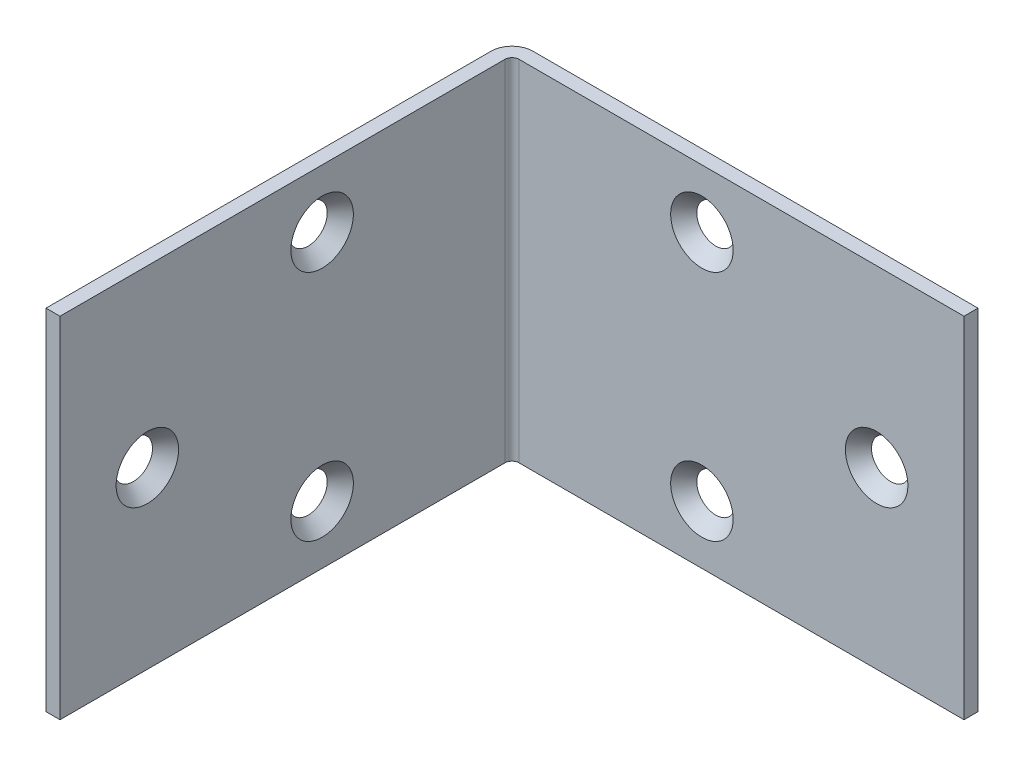
ISO-10303-21;
HEADER;
FILE_DESCRIPTION(('STEP AP214'),'2;1');
FILE_NAME('part.step','',(''),(''),'','','');
FILE_SCHEMA(('AUTOMOTIVE_DESIGN { 1 0 10303 214 1 1 1 1 }'));
ENDSEC;
DATA;
#1=APPLICATION_CONTEXT('core data for automotive mechanical design processes');
#2=APPLICATION_PROTOCOL_DEFINITION('international standard','automotive_design',2000,#1);
#3=PRODUCT_CONTEXT('',#1,'mechanical');
#4=PRODUCT('Part','Part','',(#3));
#5=PRODUCT_RELATED_PRODUCT_CATEGORY('part','',(#4));
#6=PRODUCT_DEFINITION_FORMATION('','',#4);
#7=PRODUCT_DEFINITION_CONTEXT('part definition',#1,'design');
#8=PRODUCT_DEFINITION('design','',#6,#7);
#9=PRODUCT_DEFINITION_SHAPE('','',#8);
#10=(LENGTH_UNIT() NAMED_UNIT(*) SI_UNIT(.MILLI.,.METRE.));
#11=(NAMED_UNIT(*) PLANE_ANGLE_UNIT() SI_UNIT($,.RADIAN.));
#12=(NAMED_UNIT(*) SI_UNIT($,.STERADIAN.) SOLID_ANGLE_UNIT());
#13=UNCERTAINTY_MEASURE_WITH_UNIT(LENGTH_MEASURE(1.E-05),#10,'distance_accuracy_value','');
#14=(GEOMETRIC_REPRESENTATION_CONTEXT(3) GLOBAL_UNCERTAINTY_ASSIGNED_CONTEXT((#13)) GLOBAL_UNIT_ASSIGNED_CONTEXT((#10,
#11,#12)) REPRESENTATION_CONTEXT('',''));
#15=CARTESIAN_POINT('',(0.,0.,0.));
#16=DIRECTION('',(0.,0.,1.));
#17=DIRECTION('',(1.,0.,0.));
#18=AXIS2_PLACEMENT_3D('',#15,#16,#17);
#19=CARTESIAN_POINT('',(2.286,19.05,1.524));
#20=DIRECTION('',(0.,0.,-1.));
#21=DIRECTION('',(-1.,0.,0.));
#22=AXIS2_PLACEMENT_3D('',#19,#20,#21);
#23=PLANE('',#22);
#24=CARTESIAN_POINT('',(22.225,12.7,1.524));
#25=DIRECTION('',(0.,0.,-1.));
#26=DIRECTION('',(-1.,0.,0.));
#27=AXIS2_PLACEMENT_3D('',#24,#25,#26);
#28=CIRCLE('',#27,3.40759298843187);
#29=CARTESIAN_POINT('',(18.8174070115681,12.7,1.524));
#30=VERTEX_POINT('',#29);
#31=EDGE_CURVE('E203',#30,#30,#28,.F.);
#32=ORIENTED_EDGE('',*,*,#31,.F.);
#33=EDGE_LOOP('',(#32));
#34=FACE_BOUND('',#33,.T.);
#35=DIRECTION('',(1.,0.,0.));
#36=VECTOR('',#35,1.);
#37=CARTESIAN_POINT('',(2.286,-19.05,1.524));
#38=LINE('',#37,#36);
#39=CARTESIAN_POINT('',(2.286,-19.05,1.524));
#40=VERTEX_POINT('',#39);
#41=CARTESIAN_POINT('',(50.8,-19.05,1.524));
#42=VERTEX_POINT('',#41);
#43=EDGE_CURVE('E131',#40,#42,#38,.T.);
#44=ORIENTED_EDGE('',*,*,#43,.T.);
#45=DIRECTION('',(0.,-1.,0.));
#46=VECTOR('',#45,1.);
#47=CARTESIAN_POINT('',(50.8,19.05,1.524));
#48=LINE('',#47,#46);
#49=CARTESIAN_POINT('',(50.8,19.05,1.524));
#50=VERTEX_POINT('',#49);
#51=EDGE_CURVE('E11',#50,#42,#48,.T.);
#52=ORIENTED_EDGE('',*,*,#51,.F.);
#53=DIRECTION('',(1.,0.,0.));
#54=VECTOR('',#53,1.);
#55=CARTESIAN_POINT('',(2.286,19.05,1.524));
#56=LINE('',#55,#54);
#57=CARTESIAN_POINT('',(2.286,19.05,1.524));
#58=VERTEX_POINT('',#57);
#59=EDGE_CURVE('E89',#58,#50,#56,.T.);
#60=ORIENTED_EDGE('',*,*,#59,.F.);
#61=DIRECTION('',(0.,-1.,0.));
#62=VECTOR('',#61,1.);
#63=CARTESIAN_POINT('',(2.286,19.05,1.524));
#64=LINE('',#63,#62);
#65=EDGE_CURVE('E130',#58,#40,#64,.T.);
#66=ORIENTED_EDGE('',*,*,#65,.T.);
#67=EDGE_LOOP('',(#44,#52,#60,#66));
#68=FACE_BOUND('',#67,.T.);
#69=CARTESIAN_POINT('',(22.225,-12.7,1.524));
#70=DIRECTION('',(0.,0.,-1.));
#71=DIRECTION('',(-1.,0.,0.));
#72=AXIS2_PLACEMENT_3D('',#69,#70,#71);
#73=CIRCLE('',#72,3.40759298843187);
#74=CARTESIAN_POINT('',(18.8174070115681,-12.7,1.524));
#75=VERTEX_POINT('',#74);
#76=EDGE_CURVE('E197',#75,#75,#73,.F.);
#77=ORIENTED_EDGE('',*,*,#76,.F.);
#78=EDGE_LOOP('',(#77));
#79=FACE_BOUND('',#78,.T.);
#80=CARTESIAN_POINT('',(41.275,0.,1.524));
#81=DIRECTION('',(0.,0.,-1.));
#82=DIRECTION('',(-1.,0.,0.));
#83=AXIS2_PLACEMENT_3D('',#80,#81,#82);
#84=CIRCLE('',#83,3.40759298843181);
#85=CARTESIAN_POINT('',(37.8674070115682,0.,1.524));
#86=VERTEX_POINT('',#85);
#87=EDGE_CURVE('E209',#86,#86,#84,.F.);
#88=ORIENTED_EDGE('',*,*,#87,.F.);
#89=EDGE_LOOP('',(#88));
#90=FACE_BOUND('',#89,.T.);
#91=ADVANCED_FACE('F34',(#34,#68,#79,#90),#23,.F.);
#92=CARTESIAN_POINT('',(2.286,19.05,0.));
#93=DIRECTION('',(0.,0.,-1.));
#94=DIRECTION('',(-1.,0.,0.));
#95=AXIS2_PLACEMENT_3D('',#92,#93,#94);
#96=PLANE('',#95);
#97=CARTESIAN_POINT('',(22.225,12.7,0.));
#98=DIRECTION('',(0.,0.,1.));
#99=DIRECTION('',(1.,0.,0.));
#100=AXIS2_PLACEMENT_3D('',#97,#98,#99);
#101=CIRCLE('',#100,2.0828);
#102=CARTESIAN_POINT('',(24.3078,12.7,0.));
#103=VERTEX_POINT('',#102);
#104=EDGE_CURVE('E206',#103,#103,#101,.T.);
#105=ORIENTED_EDGE('',*,*,#104,.T.);
#106=EDGE_LOOP('',(#105));
#107=FACE_BOUND('',#106,.T.);
#108=DIRECTION('',(1.,0.,0.));
#109=VECTOR('',#108,1.);
#110=CARTESIAN_POINT('',(2.286,-19.05,0.));
#111=LINE('',#110,#109);
#112=CARTESIAN_POINT('',(2.286,-19.05,0.));
#113=VERTEX_POINT('',#112);
#114=CARTESIAN_POINT('',(50.8,-19.05,0.));
#115=VERTEX_POINT('',#114);
#116=EDGE_CURVE('E138',#113,#115,#111,.T.);
#117=ORIENTED_EDGE('',*,*,#116,.F.);
#118=DIRECTION('',(0.,-1.,0.));
#119=VECTOR('',#118,1.);
#120=CARTESIAN_POINT('',(2.286,19.05,0.));
#121=LINE('',#120,#119);
#122=CARTESIAN_POINT('',(2.286,19.05,0.));
#123=VERTEX_POINT('',#122);
#124=EDGE_CURVE('E155',#123,#113,#121,.T.);
#125=ORIENTED_EDGE('',*,*,#124,.F.);
#126=DIRECTION('',(1.,0.,0.));
#127=VECTOR('',#126,1.);
#128=CARTESIAN_POINT('',(2.286,19.05,0.));
#129=LINE('',#128,#127);
#130=CARTESIAN_POINT('',(50.8,19.05,0.));
#131=VERTEX_POINT('',#130);
#132=EDGE_CURVE('E163',#123,#131,#129,.T.);
#133=ORIENTED_EDGE('',*,*,#132,.T.);
#134=DIRECTION('',(0.,-1.,0.));
#135=VECTOR('',#134,1.);
#136=CARTESIAN_POINT('',(50.8,19.05,0.));
#137=LINE('',#136,#135);
#138=EDGE_CURVE('E42',#131,#115,#137,.T.);
#139=ORIENTED_EDGE('',*,*,#138,.T.);
#140=EDGE_LOOP('',(#117,#125,#133,#139));
#141=FACE_BOUND('',#140,.T.);
#142=CARTESIAN_POINT('',(41.275,0.,1.3747336602421E-13));
#143=DIRECTION('',(0.,0.,1.));
#144=DIRECTION('',(1.,0.,0.));
#145=AXIS2_PLACEMENT_3D('',#142,#143,#144);
#146=CIRCLE('',#145,2.0828);
#147=CARTESIAN_POINT('',(43.3578,0.,1.44410483571278E-13));
#148=VERTEX_POINT('',#147);
#149=EDGE_CURVE('E212',#148,#148,#146,.T.);
#150=ORIENTED_EDGE('',*,*,#149,.T.);
#151=EDGE_LOOP('',(#150));
#152=FACE_BOUND('',#151,.T.);
#153=CARTESIAN_POINT('',(22.225,-12.7,0.));
#154=DIRECTION('',(0.,0.,1.));
#155=DIRECTION('',(1.,0.,0.));
#156=AXIS2_PLACEMENT_3D('',#153,#154,#155);
#157=CIRCLE('',#156,2.0828);
#158=CARTESIAN_POINT('',(24.3078,-12.7,0.));
#159=VERTEX_POINT('',#158);
#160=EDGE_CURVE('E200',#159,#159,#157,.T.);
#161=ORIENTED_EDGE('',*,*,#160,.T.);
#162=EDGE_LOOP('',(#161));
#163=FACE_BOUND('',#162,.T.);
#164=ADVANCED_FACE('F160',(#107,#141,#152,#163),#96,.T.);
#165=CARTESIAN_POINT('',(50.8,19.05,0.));
#166=DIRECTION('',(1.,0.,0.));
#167=DIRECTION('',(0.,0.,-1.));
#168=AXIS2_PLACEMENT_3D('',#165,#166,#167);
#169=PLANE('',#168);
#170=DIRECTION('',(0.,0.,1.));
#171=VECTOR('',#170,1.);
#172=CARTESIAN_POINT('',(50.8,-19.05,0.));
#173=LINE('',#172,#171);
#174=EDGE_CURVE('E134',#115,#42,#173,.T.);
#175=ORIENTED_EDGE('',*,*,#174,.F.);
#176=ORIENTED_EDGE('',*,*,#138,.F.);
#177=DIRECTION('',(0.,0.,1.));
#178=VECTOR('',#177,1.);
#179=CARTESIAN_POINT('',(50.8,19.05,0.));
#180=LINE('',#179,#178);
#181=EDGE_CURVE('E175',#131,#50,#180,.T.);
#182=ORIENTED_EDGE('',*,*,#181,.T.);
#183=ORIENTED_EDGE('',*,*,#51,.T.);
#184=EDGE_LOOP('',(#175,#176,#182,#183));
#185=FACE_BOUND('',#184,.T.);
#186=ADVANCED_FACE('F166',(#185),#169,.T.);
#187=CARTESIAN_POINT('',(2.286,19.05,2.286));
#188=DIRECTION('',(0.,-1.,0.));
#189=DIRECTION('',(0.,0.,-1.));
#190=AXIS2_PLACEMENT_3D('',#187,#188,#189);
#191=CYLINDRICAL_SURFACE('',#190,2.286);
#192=CARTESIAN_POINT('',(2.286,-19.05,2.286));
#193=DIRECTION('',(0.,-1.,0.));
#194=DIRECTION('',(0.,0.,1.));
#195=AXIS2_PLACEMENT_3D('',#192,#193,#194);
#196=CIRCLE('',#195,2.286);
#197=CARTESIAN_POINT('',(0.,-19.05,2.286));
#198=VERTEX_POINT('',#197);
#199=EDGE_CURVE('E141',#198,#113,#196,.T.);
#200=ORIENTED_EDGE('',*,*,#199,.F.);
#201=DIRECTION('',(0.,-1.,0.));
#202=VECTOR('',#201,1.);
#203=CARTESIAN_POINT('',(0.,19.05,2.286));
#204=LINE('',#203,#202);
#205=CARTESIAN_POINT('',(0.,19.05,2.286));
#206=VERTEX_POINT('',#205);
#207=EDGE_CURVE('E153',#206,#198,#204,.T.);
#208=ORIENTED_EDGE('',*,*,#207,.F.);
#209=CARTESIAN_POINT('',(2.286,19.05,2.286));
#210=DIRECTION('',(0.,-1.,0.));
#211=DIRECTION('',(0.,0.,1.));
#212=AXIS2_PLACEMENT_3D('',#209,#210,#211);
#213=CIRCLE('',#212,2.286);
#214=EDGE_CURVE('E125',#206,#123,#213,.T.);
#215=ORIENTED_EDGE('',*,*,#214,.T.);
#216=ORIENTED_EDGE('',*,*,#124,.T.);
#217=EDGE_LOOP('',(#200,#208,#215,#216));
#218=FACE_BOUND('',#217,.T.);
#219=ADVANCED_FACE('F173',(#218),#191,.T.);
#220=CARTESIAN_POINT('',(0.,19.05,50.8));
#221=DIRECTION('',(-1.,0.,0.));
#222=DIRECTION('',(0.,0.,1.));
#223=AXIS2_PLACEMENT_3D('',#220,#221,#222);
#224=PLANE('',#223);
#225=CARTESIAN_POINT('',(0.,-12.7,22.225));
#226=DIRECTION('',(-1.,0.,0.));
#227=DIRECTION('',(0.,0.,1.));
#228=AXIS2_PLACEMENT_3D('',#225,#226,#227);
#229=CIRCLE('',#228,2.0828);
#230=CARTESIAN_POINT('',(0.,-12.7,24.3078));
#231=VERTEX_POINT('',#230);
#232=EDGE_CURVE('E182',#231,#231,#229,.T.);
#233=ORIENTED_EDGE('',*,*,#232,.F.);
#234=EDGE_LOOP('',(#233));
#235=FACE_BOUND('',#234,.T.);
#236=CARTESIAN_POINT('',(0.,12.7,22.225));
#237=DIRECTION('',(-1.,0.,0.));
#238=DIRECTION('',(0.,0.,1.));
#239=AXIS2_PLACEMENT_3D('',#236,#237,#238);
#240=CIRCLE('',#239,2.0828);
#241=CARTESIAN_POINT('',(0.,12.7,24.3078));
#242=VERTEX_POINT('',#241);
#243=EDGE_CURVE('E188',#242,#242,#240,.T.);
#244=ORIENTED_EDGE('',*,*,#243,.F.);
#245=EDGE_LOOP('',(#244));
#246=FACE_BOUND('',#245,.T.);
#247=CARTESIAN_POINT('',(0.,0.,41.275));
#248=DIRECTION('',(-1.,0.,0.));
#249=DIRECTION('',(0.,0.,1.));
#250=AXIS2_PLACEMENT_3D('',#247,#248,#249);
#251=CIRCLE('',#250,2.0828);
#252=CARTESIAN_POINT('',(0.,0.,43.3578));
#253=VERTEX_POINT('',#252);
#254=EDGE_CURVE('E194',#253,#253,#251,.T.);
#255=ORIENTED_EDGE('',*,*,#254,.F.);
#256=EDGE_LOOP('',(#255));
#257=FACE_BOUND('',#256,.T.);
#258=DIRECTION('',(0.,0.,-1.));
#259=VECTOR('',#258,1.);
#260=CARTESIAN_POINT('',(0.,-19.05,50.8));
#261=LINE('',#260,#259);
#262=CARTESIAN_POINT('',(0.,-19.05,50.8));
#263=VERTEX_POINT('',#262);
#264=EDGE_CURVE('E144',#263,#198,#261,.T.);
#265=ORIENTED_EDGE('',*,*,#264,.F.);
#266=DIRECTION('',(0.,-1.,0.));
#267=VECTOR('',#266,1.);
#268=CARTESIAN_POINT('',(0.,19.05,50.8));
#269=LINE('',#268,#267);
#270=CARTESIAN_POINT('',(0.,19.05,50.8));
#271=VERTEX_POINT('',#270);
#272=EDGE_CURVE('E113',#271,#263,#269,.T.);
#273=ORIENTED_EDGE('',*,*,#272,.F.);
#274=DIRECTION('',(0.,0.,-1.));
#275=VECTOR('',#274,1.);
#276=CARTESIAN_POINT('',(0.,19.05,50.8));
#277=LINE('',#276,#275);
#278=EDGE_CURVE('E123',#271,#206,#277,.T.);
#279=ORIENTED_EDGE('',*,*,#278,.T.);
#280=ORIENTED_EDGE('',*,*,#207,.T.);
#281=EDGE_LOOP('',(#265,#273,#279,#280));
#282=FACE_BOUND('',#281,.T.);
#283=ADVANCED_FACE('F271',(#235,#246,#257,#282),#224,.T.);
#284=CARTESIAN_POINT('',(1.524,19.05,50.8));
#285=DIRECTION('',(0.,0.,1.));
#286=DIRECTION('',(1.,0.,0.));
#287=AXIS2_PLACEMENT_3D('',#284,#285,#286);
#288=PLANE('',#287);
#289=DIRECTION('',(-1.,0.,0.));
#290=VECTOR('',#289,1.);
#291=CARTESIAN_POINT('',(1.524,-19.05,50.8));
#292=LINE('',#291,#290);
#293=CARTESIAN_POINT('',(1.524,-19.05,50.8));
#294=VERTEX_POINT('',#293);
#295=EDGE_CURVE('E112',#294,#263,#292,.T.);
#296=ORIENTED_EDGE('',*,*,#295,.F.);
#297=DIRECTION('',(0.,-1.,0.));
#298=VECTOR('',#297,1.);
#299=CARTESIAN_POINT('',(1.524,19.05,50.8));
#300=LINE('',#299,#298);
#301=CARTESIAN_POINT('',(1.524,19.05,50.8));
#302=VERTEX_POINT('',#301);
#303=EDGE_CURVE('E106',#302,#294,#300,.T.);
#304=ORIENTED_EDGE('',*,*,#303,.F.);
#305=DIRECTION('',(-1.,0.,0.));
#306=VECTOR('',#305,1.);
#307=CARTESIAN_POINT('',(1.524,19.05,50.8));
#308=LINE('',#307,#306);
#309=EDGE_CURVE('E110',#302,#271,#308,.T.);
#310=ORIENTED_EDGE('',*,*,#309,.T.);
#311=ORIENTED_EDGE('',*,*,#272,.T.);
#312=EDGE_LOOP('',(#296,#304,#310,#311));
#313=FACE_BOUND('',#312,.T.);
#314=ADVANCED_FACE('F108',(#313),#288,.T.);
#315=CARTESIAN_POINT('',(1.524,19.05,50.8));
#316=DIRECTION('',(-1.,0.,0.));
#317=DIRECTION('',(0.,0.,1.));
#318=AXIS2_PLACEMENT_3D('',#315,#316,#317);
#319=PLANE('',#318);
#320=CARTESIAN_POINT('',(1.524,0.,41.275));
#321=DIRECTION('',(-1.,0.,0.));
#322=DIRECTION('',(0.,0.,1.));
#323=AXIS2_PLACEMENT_3D('',#320,#321,#322);
#324=CIRCLE('',#323,3.40759298843193);
#325=CARTESIAN_POINT('',(1.524,0.,44.6825929884319));
#326=VERTEX_POINT('',#325);
#327=EDGE_CURVE('E191',#326,#326,#324,.T.);
#328=ORIENTED_EDGE('',*,*,#327,.T.);
#329=EDGE_LOOP('',(#328));
#330=FACE_BOUND('',#329,.T.);
#331=CARTESIAN_POINT('',(1.524,12.7,22.225));
#332=DIRECTION('',(-1.,0.,0.));
#333=DIRECTION('',(0.,0.,1.));
#334=AXIS2_PLACEMENT_3D('',#331,#332,#333);
#335=CIRCLE('',#334,3.40759298843193);
#336=CARTESIAN_POINT('',(1.524,12.7,25.6325929884319));
#337=VERTEX_POINT('',#336);
#338=EDGE_CURVE('E185',#337,#337,#335,.T.);
#339=ORIENTED_EDGE('',*,*,#338,.T.);
#340=EDGE_LOOP('',(#339));
#341=FACE_BOUND('',#340,.T.);
#342=CARTESIAN_POINT('',(1.524,-12.7,22.225));
#343=DIRECTION('',(-1.,0.,0.));
#344=DIRECTION('',(0.,0.,1.));
#345=AXIS2_PLACEMENT_3D('',#342,#343,#344);
#346=CIRCLE('',#345,3.40759298843193);
#347=CARTESIAN_POINT('',(1.524,-12.7,25.6325929884319));
#348=VERTEX_POINT('',#347);
#349=EDGE_CURVE('E135',#348,#348,#346,.T.);
#350=ORIENTED_EDGE('',*,*,#349,.T.);
#351=EDGE_LOOP('',(#350));
#352=FACE_BOUND('',#351,.T.);
#353=DIRECTION('',(0.,0.,-1.));
#354=VECTOR('',#353,1.);
#355=CARTESIAN_POINT('',(1.524,-19.05,50.8));
#356=LINE('',#355,#354);
#357=CARTESIAN_POINT('',(1.524,-19.05,2.286));
#358=VERTEX_POINT('',#357);
#359=EDGE_CURVE('E77',#294,#358,#356,.T.);
#360=ORIENTED_EDGE('',*,*,#359,.T.);
#361=DIRECTION('',(0.,-1.,0.));
#362=VECTOR('',#361,1.);
#363=CARTESIAN_POINT('',(1.524,19.05,2.286));
#364=LINE('',#363,#362);
#365=CARTESIAN_POINT('',(1.524,19.05,2.286));
#366=VERTEX_POINT('',#365);
#367=EDGE_CURVE('E114',#366,#358,#364,.T.);
#368=ORIENTED_EDGE('',*,*,#367,.F.);
#369=DIRECTION('',(0.,0.,-1.));
#370=VECTOR('',#369,1.);
#371=CARTESIAN_POINT('',(1.524,19.05,50.8));
#372=LINE('',#371,#370);
#373=EDGE_CURVE('E116',#302,#366,#372,.T.);
#374=ORIENTED_EDGE('',*,*,#373,.F.);
#375=ORIENTED_EDGE('',*,*,#303,.T.);
#376=EDGE_LOOP('',(#360,#368,#374,#375));
#377=FACE_BOUND('',#376,.T.);
#378=ADVANCED_FACE('F117',(#330,#341,#352,#377),#319,.F.);
#379=CARTESIAN_POINT('',(2.286,19.05,2.286));
#380=DIRECTION('',(0.,-1.,0.));
#381=DIRECTION('',(0.,0.,-1.));
#382=AXIS2_PLACEMENT_3D('',#379,#380,#381);
#383=CYLINDRICAL_SURFACE('',#382,0.762);
#384=CARTESIAN_POINT('',(2.286,-19.05,2.286));
#385=DIRECTION('',(0.,1.,0.));
#386=DIRECTION('',(1.,0.,0.));
#387=AXIS2_PLACEMENT_3D('',#384,#385,#386);
#388=CIRCLE('',#387,0.762);
#389=EDGE_CURVE('E83',#358,#40,#388,.F.);
#390=ORIENTED_EDGE('',*,*,#389,.T.);
#391=ORIENTED_EDGE('',*,*,#65,.F.);
#392=CARTESIAN_POINT('',(2.286,19.05,2.286));
#393=DIRECTION('',(0.,1.,0.));
#394=DIRECTION('',(1.,0.,0.));
#395=AXIS2_PLACEMENT_3D('',#392,#393,#394);
#396=CIRCLE('',#395,0.762);
#397=EDGE_CURVE('E50',#366,#58,#396,.F.);
#398=ORIENTED_EDGE('',*,*,#397,.F.);
#399=ORIENTED_EDGE('',*,*,#367,.T.);
#400=EDGE_LOOP('',(#390,#391,#398,#399));
#401=FACE_BOUND('',#400,.T.);
#402=ADVANCED_FACE('F261',(#401),#383,.F.);
#403=CARTESIAN_POINT('',(2.286,19.05,2.286));
#404=DIRECTION('',(0.,-1.,0.));
#405=DIRECTION('',(-1.,0.,0.));
#406=AXIS2_PLACEMENT_3D('',#403,#404,#405);
#407=PLANE('',#406);
#408=ORIENTED_EDGE('',*,*,#59,.T.);
#409=ORIENTED_EDGE('',*,*,#181,.F.);
#410=ORIENTED_EDGE('',*,*,#132,.F.);
#411=ORIENTED_EDGE('',*,*,#214,.F.);
#412=ORIENTED_EDGE('',*,*,#278,.F.);
#413=ORIENTED_EDGE('',*,*,#309,.F.);
#414=ORIENTED_EDGE('',*,*,#373,.T.);
#415=ORIENTED_EDGE('',*,*,#397,.T.);
#416=EDGE_LOOP('',(#408,#409,#410,#411,#412,#413,#414,#415));
#417=FACE_BOUND('',#416,.T.);
#418=ADVANCED_FACE('F120',(#417),#407,.F.);
#419=CARTESIAN_POINT('',(2.286,-19.05,2.286));
#420=DIRECTION('',(0.,-1.,0.));
#421=DIRECTION('',(-1.,0.,0.));
#422=AXIS2_PLACEMENT_3D('',#419,#420,#421);
#423=PLANE('',#422);
#424=ORIENTED_EDGE('',*,*,#43,.F.);
#425=ORIENTED_EDGE('',*,*,#389,.F.);
#426=ORIENTED_EDGE('',*,*,#359,.F.);
#427=ORIENTED_EDGE('',*,*,#295,.T.);
#428=ORIENTED_EDGE('',*,*,#264,.T.);
#429=ORIENTED_EDGE('',*,*,#199,.T.);
#430=ORIENTED_EDGE('',*,*,#116,.T.);
#431=ORIENTED_EDGE('',*,*,#174,.T.);
#432=EDGE_LOOP('',(#424,#425,#426,#427,#428,#429,#430,#431));
#433=FACE_BOUND('',#432,.T.);
#434=ADVANCED_FACE('F169',(#433),#423,.T.);
#435=CARTESIAN_POINT('',(0.,-12.7,22.225));
#436=DIRECTION('',(1.,0.,0.));
#437=DIRECTION('',(0.,0.,1.));
#438=AXIS2_PLACEMENT_3D('',#435,#436,#437);
#439=CONICAL_SURFACE('',#438,2.0828,0.715584993317677);
#440=ORIENTED_EDGE('',*,*,#232,.T.);
#441=EDGE_LOOP('',(#440));
#442=FACE_BOUND('',#441,.T.);
#443=ORIENTED_EDGE('',*,*,#349,.F.);
#444=EDGE_LOOP('',(#443));
#445=FACE_BOUND('',#444,.T.);
#446=ADVANCED_FACE('F254',(#442,#445),#439,.F.);
#447=CARTESIAN_POINT('',(0.,12.7,22.225));
#448=DIRECTION('',(1.,0.,0.));
#449=DIRECTION('',(0.,0.,1.));
#450=AXIS2_PLACEMENT_3D('',#447,#448,#449);
#451=CONICAL_SURFACE('',#450,2.0828,0.715584993317677);
#452=ORIENTED_EDGE('',*,*,#243,.T.);
#453=EDGE_LOOP('',(#452));
#454=FACE_BOUND('',#453,.T.);
#455=ORIENTED_EDGE('',*,*,#338,.F.);
#456=EDGE_LOOP('',(#455));
#457=FACE_BOUND('',#456,.T.);
#458=ADVANCED_FACE('F247',(#454,#457),#451,.F.);
#459=CARTESIAN_POINT('',(0.,0.,41.275));
#460=DIRECTION('',(1.,0.,0.));
#461=DIRECTION('',(0.,0.,1.));
#462=AXIS2_PLACEMENT_3D('',#459,#460,#461);
#463=CONICAL_SURFACE('',#462,2.0828,0.715584993317677);
#464=ORIENTED_EDGE('',*,*,#254,.T.);
#465=EDGE_LOOP('',(#464));
#466=FACE_BOUND('',#465,.T.);
#467=ORIENTED_EDGE('',*,*,#327,.F.);
#468=EDGE_LOOP('',(#467));
#469=FACE_BOUND('',#468,.T.);
#470=ADVANCED_FACE('F238',(#466,#469),#463,.F.);
#471=CARTESIAN_POINT('',(22.225,-12.7,0.));
#472=DIRECTION('',(0.,0.,1.));
#473=DIRECTION('',(1.,0.,0.));
#474=AXIS2_PLACEMENT_3D('',#471,#472,#473);
#475=CONICAL_SURFACE('',#474,2.0828,0.715584993317677);
#476=ORIENTED_EDGE('',*,*,#160,.F.);
#477=EDGE_LOOP('',(#476));
#478=FACE_BOUND('',#477,.T.);
#479=ORIENTED_EDGE('',*,*,#76,.T.);
#480=EDGE_LOOP('',(#479));
#481=FACE_BOUND('',#480,.T.);
#482=ADVANCED_FACE('F236',(#478,#481),#475,.F.);
#483=CARTESIAN_POINT('',(22.225,12.7,0.));
#484=DIRECTION('',(0.,0.,1.));
#485=DIRECTION('',(1.,0.,0.));
#486=AXIS2_PLACEMENT_3D('',#483,#484,#485);
#487=CONICAL_SURFACE('',#486,2.0828,0.715584993317677);
#488=ORIENTED_EDGE('',*,*,#104,.F.);
#489=EDGE_LOOP('',(#488));
#490=FACE_BOUND('',#489,.T.);
#491=ORIENTED_EDGE('',*,*,#31,.T.);
#492=EDGE_LOOP('',(#491));
#493=FACE_BOUND('',#492,.T.);
#494=ADVANCED_FACE('F220',(#490,#493),#487,.F.);
#495=CARTESIAN_POINT('',(41.275,0.,1.3747336602421E-13));
#496=DIRECTION('',(0.,0.,1.));
#497=DIRECTION('',(1.,0.,0.));
#498=AXIS2_PLACEMENT_3D('',#495,#496,#497);
#499=CONICAL_SURFACE('',#498,2.0828,0.715584993317677);
#500=ORIENTED_EDGE('',*,*,#149,.F.);
#501=EDGE_LOOP('',(#500));
#502=FACE_BOUND('',#501,.T.);
#503=ORIENTED_EDGE('',*,*,#87,.T.);
#504=EDGE_LOOP('',(#503));
#505=FACE_BOUND('',#504,.T.);
#506=ADVANCED_FACE('F217',(#502,#505),#499,.F.);
#507=CLOSED_SHELL('',(#91,#164,#186,#219,#283,#314,#378,#402,#418,#434,#446,#458,#470,#482,#494,#506));
#508=MANIFOLD_SOLID_BREP('B2',#507);
#509=ADVANCED_BREP_SHAPE_REPRESENTATION('',(#18,#508),#14);
#510=SHAPE_DEFINITION_REPRESENTATION(#9,#509);
ENDSEC;
END-ISO-10303-21;
